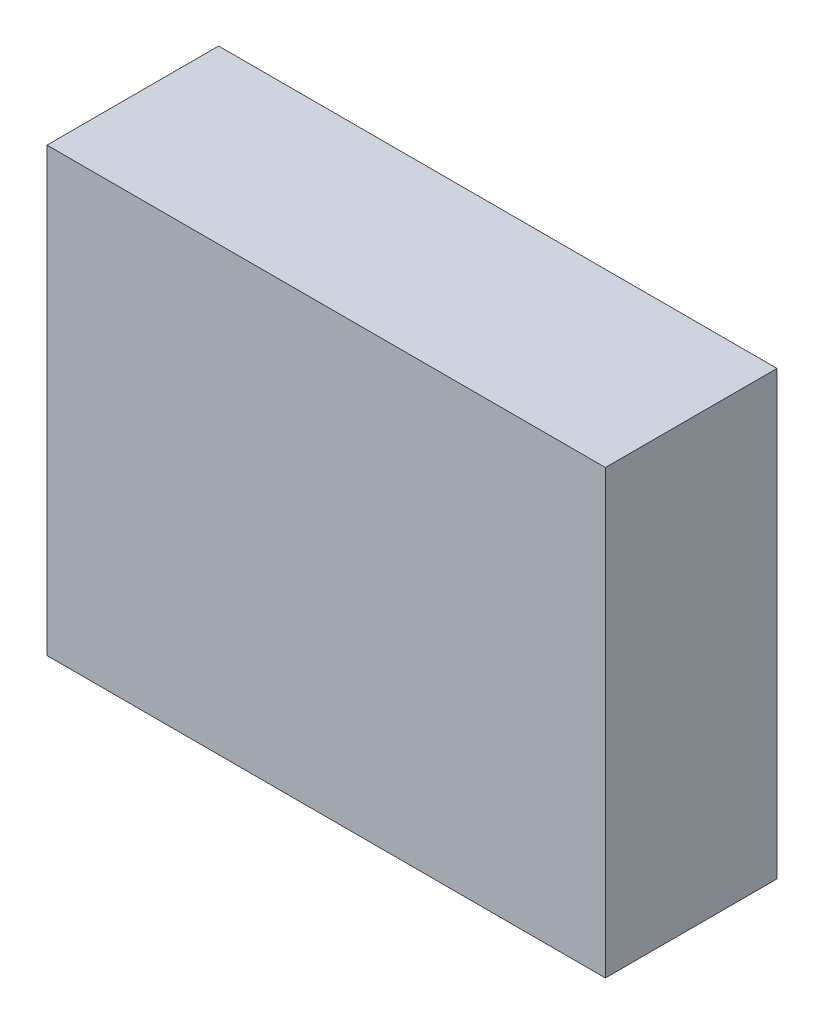
ISO-10303-21;
HEADER;
FILE_DESCRIPTION(('STEP AP214'),'2;1');
FILE_NAME('part.step','',(''),(''),'','','');
FILE_SCHEMA(('AUTOMOTIVE_DESIGN { 1 0 10303 214 1 1 1 1 }'));
ENDSEC;
DATA;
#1=APPLICATION_CONTEXT('core data for automotive mechanical design processes');
#2=APPLICATION_PROTOCOL_DEFINITION('international standard','automotive_design',2000,#1);
#3=PRODUCT_CONTEXT('',#1,'mechanical');
#4=PRODUCT('Part','Part','',(#3));
#5=PRODUCT_RELATED_PRODUCT_CATEGORY('part','',(#4));
#6=PRODUCT_DEFINITION_FORMATION('','',#4);
#7=PRODUCT_DEFINITION_CONTEXT('part definition',#1,'design');
#8=PRODUCT_DEFINITION('design','',#6,#7);
#9=PRODUCT_DEFINITION_SHAPE('','',#8);
#10=(LENGTH_UNIT() NAMED_UNIT(*) SI_UNIT(.MILLI.,.METRE.));
#11=(NAMED_UNIT(*) PLANE_ANGLE_UNIT() SI_UNIT($,.RADIAN.));
#12=(NAMED_UNIT(*) SI_UNIT($,.STERADIAN.) SOLID_ANGLE_UNIT());
#13=UNCERTAINTY_MEASURE_WITH_UNIT(LENGTH_MEASURE(1.E-05),#10,'distance_accuracy_value','');
#14=(GEOMETRIC_REPRESENTATION_CONTEXT(3) GLOBAL_UNCERTAINTY_ASSIGNED_CONTEXT((#13)) GLOBAL_UNIT_ASSIGNED_CONTEXT((#10,
#11,#12)) REPRESENTATION_CONTEXT('',''));
#15=CARTESIAN_POINT('',(0.,0.,0.));
#16=DIRECTION('',(0.,0.,1.));
#17=DIRECTION('',(1.,0.,0.));
#18=AXIS2_PLACEMENT_3D('',#15,#16,#17);
#19=CARTESIAN_POINT('',(-2.52000004,1.99499982,1.549));
#20=DIRECTION('',(0.,0.,1.));
#21=DIRECTION('',(1.,0.,0.));
#22=AXIS2_PLACEMENT_3D('',#19,#20,#21);
#23=PLANE('',#22);
#24=DIRECTION('',(0.,1.,0.));
#25=VECTOR('',#24,1.);
#26=CARTESIAN_POINT('',(2.52000004,1.99499982,1.549));
#27=LINE('',#26,#25);
#28=CARTESIAN_POINT('',(2.52000004,1.99499982,1.549));
#29=VERTEX_POINT('',#28);
#30=CARTESIAN_POINT('',(2.52000004,-1.99499982,1.549));
#31=VERTEX_POINT('',#30);
#32=EDGE_CURVE('E53',#29,#31,#27,.F.);
#33=ORIENTED_EDGE('',*,*,#32,.F.);
#34=DIRECTION('',(1.,0.,0.));
#35=VECTOR('',#34,1.);
#36=CARTESIAN_POINT('',(-2.52000004,1.99499982,1.549));
#37=LINE('',#36,#35);
#38=CARTESIAN_POINT('',(-2.52000004,1.99499982,1.549));
#39=VERTEX_POINT('',#38);
#40=EDGE_CURVE('E68',#39,#29,#37,.T.);
#41=ORIENTED_EDGE('',*,*,#40,.F.);
#42=DIRECTION('',(0.,1.,0.));
#43=VECTOR('',#42,1.);
#44=CARTESIAN_POINT('',(-2.52000004,-1.99499982,1.549));
#45=LINE('',#44,#43);
#46=CARTESIAN_POINT('',(-2.52000004,-1.99499982,1.549));
#47=VERTEX_POINT('',#46);
#48=EDGE_CURVE('E20',#47,#39,#45,.T.);
#49=ORIENTED_EDGE('',*,*,#48,.F.);
#50=DIRECTION('',(1.,0.,0.));
#51=VECTOR('',#50,1.);
#52=CARTESIAN_POINT('',(2.52000004,-1.99499982,1.549));
#53=LINE('',#52,#51);
#54=EDGE_CURVE('E58',#31,#47,#53,.F.);
#55=ORIENTED_EDGE('',*,*,#54,.F.);
#56=EDGE_LOOP('',(#33,#41,#49,#55));
#57=FACE_BOUND('',#56,.T.);
#58=ADVANCED_FACE('F17',(#57),#23,.T.);
#59=CARTESIAN_POINT('',(-2.52000004,-1.99499982,0.));
#60=DIRECTION('',(-1.,0.,0.));
#61=DIRECTION('',(0.,0.,1.));
#62=AXIS2_PLACEMENT_3D('',#59,#60,#61);
#63=PLANE('',#62);
#64=DIRECTION('',(0.,0.,1.));
#65=VECTOR('',#64,1.);
#66=CARTESIAN_POINT('',(-2.52000004,1.99499982,0.));
#67=LINE('',#66,#65);
#68=CARTESIAN_POINT('',(-2.52000004,1.99499982,0.));
#69=VERTEX_POINT('',#68);
#70=EDGE_CURVE('E79',#69,#39,#67,.T.);
#71=ORIENTED_EDGE('',*,*,#70,.F.);
#72=DIRECTION('',(0.,1.,0.));
#73=VECTOR('',#72,1.);
#74=CARTESIAN_POINT('',(-2.52000004,1.99499982,0.));
#75=LINE('',#74,#73);
#76=CARTESIAN_POINT('',(-2.52000004,-1.99499982,0.));
#77=VERTEX_POINT('',#76);
#78=EDGE_CURVE('E74',#69,#77,#75,.F.);
#79=ORIENTED_EDGE('',*,*,#78,.T.);
#80=DIRECTION('',(0.,0.,-1.));
#81=VECTOR('',#80,1.);
#82=CARTESIAN_POINT('',(-2.52000004,-1.99499982,0.));
#83=LINE('',#82,#81);
#84=EDGE_CURVE('E63',#47,#77,#83,.T.);
#85=ORIENTED_EDGE('',*,*,#84,.F.);
#86=ORIENTED_EDGE('',*,*,#48,.T.);
#87=EDGE_LOOP('',(#71,#79,#85,#86));
#88=FACE_BOUND('',#87,.T.);
#89=ADVANCED_FACE('F73',(#88),#63,.T.);
#90=CARTESIAN_POINT('',(2.52000004,-1.99499982,0.));
#91=DIRECTION('',(0.,-1.,0.));
#92=DIRECTION('',(0.,0.,-1.));
#93=AXIS2_PLACEMENT_3D('',#90,#91,#92);
#94=PLANE('',#93);
#95=ORIENTED_EDGE('',*,*,#84,.T.);
#96=DIRECTION('',(1.,0.,0.));
#97=VECTOR('',#96,1.);
#98=CARTESIAN_POINT('',(-2.52000004,-1.99499982,0.));
#99=LINE('',#98,#97);
#100=CARTESIAN_POINT('',(2.52000004,-1.99499982,0.));
#101=VERTEX_POINT('',#100);
#102=EDGE_CURVE('E84',#77,#101,#99,.T.);
#103=ORIENTED_EDGE('',*,*,#102,.T.);
#104=DIRECTION('',(0.,0.,-1.));
#105=VECTOR('',#104,1.);
#106=CARTESIAN_POINT('',(2.52000004,-1.99499982,0.));
#107=LINE('',#106,#105);
#108=EDGE_CURVE('E65',#31,#101,#107,.T.);
#109=ORIENTED_EDGE('',*,*,#108,.F.);
#110=ORIENTED_EDGE('',*,*,#54,.T.);
#111=EDGE_LOOP('',(#95,#103,#109,#110));
#112=FACE_BOUND('',#111,.T.);
#113=ADVANCED_FACE('F60',(#112),#94,.T.);
#114=CARTESIAN_POINT('',(2.52000004,1.99499982,0.));
#115=DIRECTION('',(1.,0.,0.));
#116=DIRECTION('',(0.,0.,-1.));
#117=AXIS2_PLACEMENT_3D('',#114,#115,#116);
#118=PLANE('',#117);
#119=ORIENTED_EDGE('',*,*,#108,.T.);
#120=DIRECTION('',(0.,1.,0.));
#121=VECTOR('',#120,1.);
#122=CARTESIAN_POINT('',(2.52000004,1.99499982,0.));
#123=LINE('',#122,#121);
#124=CARTESIAN_POINT('',(2.52000004,1.99499982,0.));
#125=VERTEX_POINT('',#124);
#126=EDGE_CURVE('E26',#101,#125,#123,.T.);
#127=ORIENTED_EDGE('',*,*,#126,.T.);
#128=DIRECTION('',(0.,0.,1.));
#129=VECTOR('',#128,1.);
#130=CARTESIAN_POINT('',(2.52000004,1.99499982,0.));
#131=LINE('',#130,#129);
#132=EDGE_CURVE('E34',#29,#125,#131,.F.);
#133=ORIENTED_EDGE('',*,*,#132,.F.);
#134=ORIENTED_EDGE('',*,*,#32,.T.);
#135=EDGE_LOOP('',(#119,#127,#133,#134));
#136=FACE_BOUND('',#135,.T.);
#137=ADVANCED_FACE('F88',(#136),#118,.T.);
#138=CARTESIAN_POINT('',(-2.52000004,1.99499982,0.));
#139=DIRECTION('',(0.,1.,0.));
#140=DIRECTION('',(0.,0.,1.));
#141=AXIS2_PLACEMENT_3D('',#138,#139,#140);
#142=PLANE('',#141);
#143=ORIENTED_EDGE('',*,*,#132,.T.);
#144=DIRECTION('',(1.,0.,0.));
#145=VECTOR('',#144,1.);
#146=CARTESIAN_POINT('',(-2.52000004,1.99499982,0.));
#147=LINE('',#146,#145);
#148=EDGE_CURVE('E11',#125,#69,#147,.F.);
#149=ORIENTED_EDGE('',*,*,#148,.T.);
#150=ORIENTED_EDGE('',*,*,#70,.T.);
#151=ORIENTED_EDGE('',*,*,#40,.T.);
#152=EDGE_LOOP('',(#143,#149,#150,#151));
#153=FACE_BOUND('',#152,.T.);
#154=ADVANCED_FACE('F91',(#153),#142,.T.);
#155=CARTESIAN_POINT('',(-2.52000004,1.99499982,0.));
#156=DIRECTION('',(0.,0.,1.));
#157=DIRECTION('',(1.,0.,0.));
#158=AXIS2_PLACEMENT_3D('',#155,#156,#157);
#159=PLANE('',#158);
#160=ORIENTED_EDGE('',*,*,#126,.F.);
#161=ORIENTED_EDGE('',*,*,#102,.F.);
#162=ORIENTED_EDGE('',*,*,#78,.F.);
#163=ORIENTED_EDGE('',*,*,#148,.F.);
#164=EDGE_LOOP('',(#160,#161,#162,#163));
#165=FACE_BOUND('',#164,.T.);
#166=ADVANCED_FACE('F90',(#165),#159,.F.);
#167=CLOSED_SHELL('',(#58,#89,#113,#137,#154,#166));
#168=MANIFOLD_SOLID_BREP('B1',#167);
#169=ADVANCED_BREP_SHAPE_REPRESENTATION('',(#18,#168),#14);
#170=SHAPE_DEFINITION_REPRESENTATION(#9,#169);
ENDSEC;
END-ISO-10303-21;
